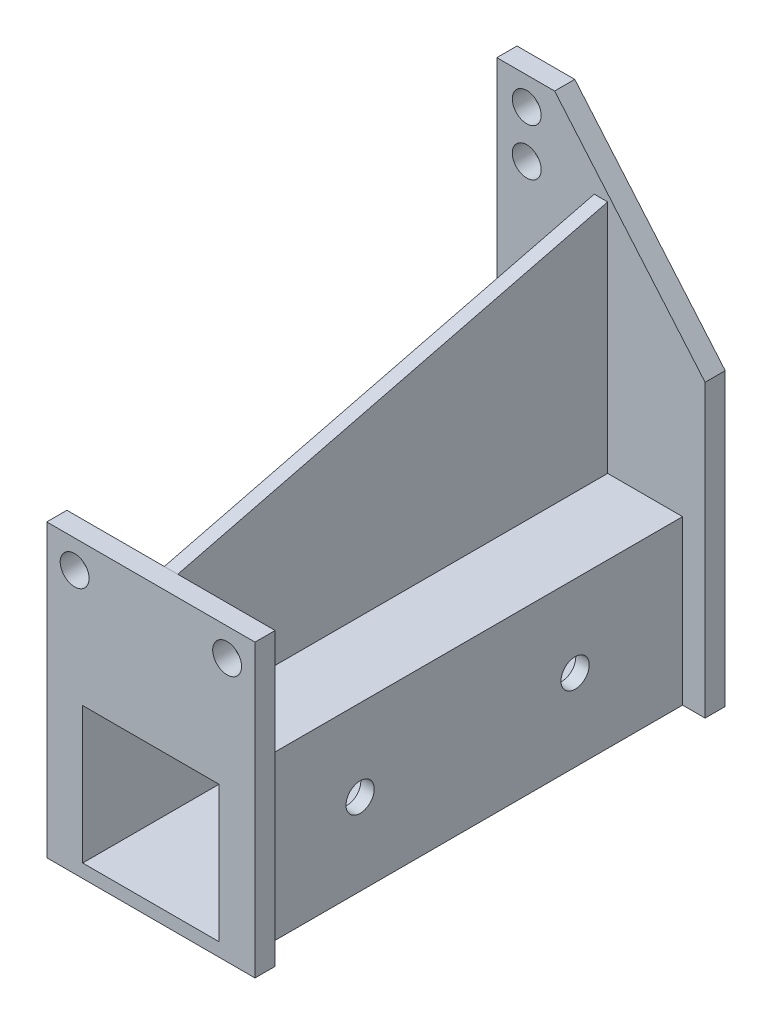
ISO-10303-21;
HEADER;
FILE_DESCRIPTION(('STEP AP214'),'2;1');
FILE_NAME('part.step','',(''),(''),'','','');
FILE_SCHEMA(('AUTOMOTIVE_DESIGN { 1 0 10303 214 1 1 1 1 }'));
ENDSEC;
DATA;
#1=APPLICATION_CONTEXT('core data for automotive mechanical design processes');
#2=APPLICATION_PROTOCOL_DEFINITION('international standard','automotive_design',2000,#1);
#3=PRODUCT_CONTEXT('',#1,'mechanical');
#4=PRODUCT('Part','Part','',(#3));
#5=PRODUCT_RELATED_PRODUCT_CATEGORY('part','',(#4));
#6=PRODUCT_DEFINITION_FORMATION('','',#4);
#7=PRODUCT_DEFINITION_CONTEXT('part definition',#1,'design');
#8=PRODUCT_DEFINITION('design','',#6,#7);
#9=PRODUCT_DEFINITION_SHAPE('','',#8);
#10=(LENGTH_UNIT() NAMED_UNIT(*) SI_UNIT(.MILLI.,.METRE.));
#11=(NAMED_UNIT(*) PLANE_ANGLE_UNIT() SI_UNIT($,.RADIAN.));
#12=(NAMED_UNIT(*) SI_UNIT($,.STERADIAN.) SOLID_ANGLE_UNIT());
#13=UNCERTAINTY_MEASURE_WITH_UNIT(LENGTH_MEASURE(1.E-05),#10,'distance_accuracy_value','');
#14=(GEOMETRIC_REPRESENTATION_CONTEXT(3) GLOBAL_UNCERTAINTY_ASSIGNED_CONTEXT((#13)) GLOBAL_UNIT_ASSIGNED_CONTEXT((#10,
#11,#12)) REPRESENTATION_CONTEXT('',''));
#15=CARTESIAN_POINT('',(0.,0.,0.));
#16=DIRECTION('',(0.,0.,1.));
#17=DIRECTION('',(1.,0.,0.));
#18=AXIS2_PLACEMENT_3D('',#15,#16,#17);
#19=CARTESIAN_POINT('',(-12.15,12.15,35.));
#20=DIRECTION('',(0.,-1.,0.));
#21=DIRECTION('',(0.,0.,-1.));
#22=AXIS2_PLACEMENT_3D('',#19,#20,#21);
#23=PLANE('',#22);
#24=DIRECTION('',(0.,0.,-1.));
#25=VECTOR('',#24,1.);
#26=CARTESIAN_POINT('',(1.,12.15,32.));
#27=LINE('',#26,#25);
#28=CARTESIAN_POINT('',(1.,12.15,32.));
#29=VERTEX_POINT('',#28);
#30=CARTESIAN_POINT('',(1.,12.15,-32.));
#31=VERTEX_POINT('',#30);
#32=EDGE_CURVE('E189',#29,#31,#27,.T.);
#33=ORIENTED_EDGE('',*,*,#32,.F.);
#34=DIRECTION('',(-1.,0.,0.));
#35=VECTOR('',#34,1.);
#36=CARTESIAN_POINT('',(0.,12.15,32.));
#37=LINE('',#36,#35);
#38=CARTESIAN_POINT('',(12.15,12.15,32.));
#39=VERTEX_POINT('',#38);
#40=EDGE_CURVE('E199',#39,#29,#37,.T.);
#41=ORIENTED_EDGE('',*,*,#40,.F.);
#42=DIRECTION('',(0.,0.,-1.));
#43=VECTOR('',#42,1.);
#44=CARTESIAN_POINT('',(12.15,12.15,35.));
#45=LINE('',#44,#43);
#46=CARTESIAN_POINT('',(12.15,12.15,-32.));
#47=VERTEX_POINT('',#46);
#48=EDGE_CURVE('E11',#39,#47,#45,.T.);
#49=ORIENTED_EDGE('',*,*,#48,.T.);
#50=DIRECTION('',(1.,0.,0.));
#51=VECTOR('',#50,1.);
#52=CARTESIAN_POINT('',(0.,12.15,-32.));
#53=LINE('',#52,#51);
#54=EDGE_CURVE('E65',#31,#47,#53,.T.);
#55=ORIENTED_EDGE('',*,*,#54,.F.);
#56=EDGE_LOOP('',(#33,#41,#49,#55));
#57=FACE_BOUND('',#56,.T.);
#58=ADVANCED_FACE('F40',(#57),#23,.F.);
#59=CARTESIAN_POINT('',(0.,0.,32.));
#60=DIRECTION('',(0.,0.,1.));
#61=DIRECTION('',(1.,0.,0.));
#62=AXIS2_PLACEMENT_3D('',#59,#60,#61);
#63=PLANE('',#62);
#64=CARTESIAN_POINT('',(11.35,27.,32.));
#65=DIRECTION('',(0.,0.,1.));
#66=DIRECTION('',(1.,0.,0.));
#67=AXIS2_PLACEMENT_3D('',#64,#65,#66);
#68=CIRCLE('',#67,2.15);
#69=CARTESIAN_POINT('',(13.5,27.,32.));
#70=VERTEX_POINT('',#69);
#71=EDGE_CURVE('E208',#70,#70,#68,.T.);
#72=ORIENTED_EDGE('',*,*,#71,.T.);
#73=EDGE_LOOP('',(#72));
#74=FACE_BOUND('',#73,.T.);
#75=DIRECTION('',(0.,-1.,0.));
#76=VECTOR('',#75,1.);
#77=CARTESIAN_POINT('',(1.,12.15,32.));
#78=LINE('',#77,#76);
#79=CARTESIAN_POINT('',(1.,31.15,32.));
#80=VERTEX_POINT('',#79);
#81=EDGE_CURVE('E186',#80,#29,#78,.T.);
#82=ORIENTED_EDGE('',*,*,#81,.F.);
#83=DIRECTION('',(1.,0.,0.));
#84=VECTOR('',#83,1.);
#85=CARTESIAN_POINT('',(0.,31.15,32.));
#86=LINE('',#85,#84);
#87=CARTESIAN_POINT('',(15.5,31.15,32.));
#88=VERTEX_POINT('',#87);
#89=EDGE_CURVE('E394',#80,#88,#86,.T.);
#90=ORIENTED_EDGE('',*,*,#89,.T.);
#91=DIRECTION('',(0.,-1.,0.));
#92=VECTOR('',#91,1.);
#93=CARTESIAN_POINT('',(15.5,0.,32.));
#94=LINE('',#93,#92);
#95=CARTESIAN_POINT('',(15.5,-12.15,32.));
#96=VERTEX_POINT('',#95);
#97=EDGE_CURVE('E392',#88,#96,#94,.T.);
#98=ORIENTED_EDGE('',*,*,#97,.T.);
#99=DIRECTION('',(1.,0.,0.));
#100=VECTOR('',#99,1.);
#101=CARTESIAN_POINT('',(0.,-12.15,32.));
#102=LINE('',#101,#100);
#103=CARTESIAN_POINT('',(12.15,-12.15,32.));
#104=VERTEX_POINT('',#103);
#105=EDGE_CURVE('E234',#104,#96,#102,.T.);
#106=ORIENTED_EDGE('',*,*,#105,.F.);
#107=DIRECTION('',(0.,1.,0.));
#108=VECTOR('',#107,1.);
#109=CARTESIAN_POINT('',(12.15,0.,32.));
#110=LINE('',#109,#108);
#111=EDGE_CURVE('E205',#104,#39,#110,.T.);
#112=ORIENTED_EDGE('',*,*,#111,.T.);
#113=ORIENTED_EDGE('',*,*,#40,.T.);
#114=EDGE_LOOP('',(#82,#90,#98,#106,#112,#113));
#115=FACE_BOUND('',#114,.T.);
#116=ADVANCED_FACE('F203',(#74,#115),#63,.F.);
#117=CARTESIAN_POINT('',(0.,0.,-32.));
#118=DIRECTION('',(0.,0.,-1.));
#119=DIRECTION('',(-1.,0.,0.));
#120=AXIS2_PLACEMENT_3D('',#117,#118,#119);
#121=PLANE('',#120);
#122=CARTESIAN_POINT('',(-11.05,46.35,-32.));
#123=DIRECTION('',(0.,0.,-1.));
#124=DIRECTION('',(-1.,0.,0.));
#125=AXIS2_PLACEMENT_3D('',#122,#123,#124);
#126=CIRCLE('',#125,2.15);
#127=CARTESIAN_POINT('',(-13.2,46.35,-32.));
#128=VERTEX_POINT('',#127);
#129=EDGE_CURVE('E333',#128,#128,#126,.T.);
#130=ORIENTED_EDGE('',*,*,#129,.T.);
#131=EDGE_LOOP('',(#130));
#132=FACE_BOUND('',#131,.T.);
#133=CARTESIAN_POINT('',(-11.05,53.35,-32.));
#134=DIRECTION('',(0.,0.,-1.));
#135=DIRECTION('',(-1.,0.,0.));
#136=AXIS2_PLACEMENT_3D('',#133,#134,#135);
#137=CIRCLE('',#136,2.15);
#138=CARTESIAN_POINT('',(-13.2,53.35,-32.));
#139=VERTEX_POINT('',#138);
#140=EDGE_CURVE('E330',#139,#139,#137,.T.);
#141=ORIENTED_EDGE('',*,*,#140,.T.);
#142=EDGE_LOOP('',(#141));
#143=FACE_BOUND('',#142,.T.);
#144=DIRECTION('',(0.,1.,0.));
#145=VECTOR('',#144,1.);
#146=CARTESIAN_POINT('',(1.,47.15,-32.));
#147=LINE('',#146,#145);
#148=CARTESIAN_POINT('',(1.,47.15,-32.));
#149=VERTEX_POINT('',#148);
#150=EDGE_CURVE('E201',#31,#149,#147,.T.);
#151=ORIENTED_EDGE('',*,*,#150,.F.);
#152=ORIENTED_EDGE('',*,*,#54,.T.);
#153=DIRECTION('',(0.,-1.,0.));
#154=VECTOR('',#153,1.);
#155=CARTESIAN_POINT('',(12.15,0.,-32.));
#156=LINE('',#155,#154);
#157=CARTESIAN_POINT('',(12.15,-12.15,-32.));
#158=VERTEX_POINT('',#157);
#159=EDGE_CURVE('E358',#47,#158,#156,.T.);
#160=ORIENTED_EDGE('',*,*,#159,.T.);
#161=DIRECTION('',(-1.,0.,0.));
#162=VECTOR('',#161,1.);
#163=CARTESIAN_POINT('',(0.,-12.15,-32.));
#164=LINE('',#163,#162);
#165=CARTESIAN_POINT('',(15.5,-12.15,-32.));
#166=VERTEX_POINT('',#165);
#167=EDGE_CURVE('E355',#166,#158,#164,.T.);
#168=ORIENTED_EDGE('',*,*,#167,.F.);
#169=DIRECTION('',(0.,-1.,0.));
#170=VECTOR('',#169,1.);
#171=CARTESIAN_POINT('',(15.5,0.,-32.));
#172=LINE('',#171,#170);
#173=CARTESIAN_POINT('',(15.5,31.15,-32.));
#174=VERTEX_POINT('',#173);
#175=EDGE_CURVE('E352',#174,#166,#172,.T.);
#176=ORIENTED_EDGE('',*,*,#175,.F.);
#177=DIRECTION('',(0.647690385367679,-0.761903645287426,0.));
#178=VECTOR('',#177,1.);
#179=CARTESIAN_POINT('',(24.3695353372363,20.7164171367778,-32.));
#180=LINE('',#179,#178);
#181=CARTESIAN_POINT('',(-6.9,57.5,-32.));
#182=VERTEX_POINT('',#181);
#183=EDGE_CURVE('E349',#182,#174,#180,.T.);
#184=ORIENTED_EDGE('',*,*,#183,.F.);
#185=DIRECTION('',(1.,0.,0.));
#186=VECTOR('',#185,1.);
#187=CARTESIAN_POINT('',(0.,57.5,-32.));
#188=LINE('',#187,#186);
#189=CARTESIAN_POINT('',(-15.5,57.5,-32.));
#190=VERTEX_POINT('',#189);
#191=EDGE_CURVE('E346',#190,#182,#188,.T.);
#192=ORIENTED_EDGE('',*,*,#191,.F.);
#193=DIRECTION('',(0.,1.,0.));
#194=VECTOR('',#193,1.);
#195=CARTESIAN_POINT('',(-15.5,0.,-32.));
#196=LINE('',#195,#194);
#197=CARTESIAN_POINT('',(-15.5,-12.15,-32.));
#198=VERTEX_POINT('',#197);
#199=EDGE_CURVE('E343',#198,#190,#196,.T.);
#200=ORIENTED_EDGE('',*,*,#199,.F.);
#201=DIRECTION('',(-1.,0.,0.));
#202=VECTOR('',#201,1.);
#203=CARTESIAN_POINT('',(0.,-12.15,-32.));
#204=LINE('',#203,#202);
#205=CARTESIAN_POINT('',(-12.15,-12.15,-32.));
#206=VERTEX_POINT('',#205);
#207=EDGE_CURVE('E340',#206,#198,#204,.T.);
#208=ORIENTED_EDGE('',*,*,#207,.F.);
#209=DIRECTION('',(0.,1.,0.));
#210=VECTOR('',#209,1.);
#211=CARTESIAN_POINT('',(-12.15,0.,-32.));
#212=LINE('',#211,#210);
#213=CARTESIAN_POINT('',(-12.15,12.15,-32.));
#214=VERTEX_POINT('',#213);
#215=EDGE_CURVE('E337',#206,#214,#212,.T.);
#216=ORIENTED_EDGE('',*,*,#215,.T.);
#217=CARTESIAN_POINT('',(-1.,12.15,-32.));
#218=VERTEX_POINT('',#217);
#219=EDGE_CURVE('E360',#214,#218,#53,.T.);
#220=ORIENTED_EDGE('',*,*,#219,.T.);
#221=DIRECTION('',(0.,1.,0.));
#222=VECTOR('',#221,1.);
#223=CARTESIAN_POINT('',(-1.,47.15,-32.));
#224=LINE('',#223,#222);
#225=CARTESIAN_POINT('',(-1.,47.15,-32.));
#226=VERTEX_POINT('',#225);
#227=EDGE_CURVE('E321',#218,#226,#224,.T.);
#228=ORIENTED_EDGE('',*,*,#227,.T.);
#229=DIRECTION('',(-1.,0.,0.));
#230=VECTOR('',#229,1.);
#231=CARTESIAN_POINT('',(1.,47.15,-32.));
#232=LINE('',#231,#230);
#233=EDGE_CURVE('E327',#149,#226,#232,.T.);
#234=ORIENTED_EDGE('',*,*,#233,.F.);
#235=EDGE_LOOP('',(#151,#152,#160,#168,#176,#184,#192,#200,#208,#216,#220,#228,#234));
#236=FACE_BOUND('',#235,.T.);
#237=ADVANCED_FACE('F415',(#132,#143,#236),#121,.F.);
#238=CARTESIAN_POINT('',(12.15,-12.15,35.));
#239=DIRECTION('',(-1.,0.,0.));
#240=DIRECTION('',(0.,0.,1.));
#241=AXIS2_PLACEMENT_3D('',#238,#239,#240);
#242=PLANE('',#241);
#243=CARTESIAN_POINT('',(12.15,0.,16.));
#244=DIRECTION('',(1.,0.,0.));
#245=DIRECTION('',(0.,0.,-1.));
#246=AXIS2_PLACEMENT_3D('',#243,#244,#245);
#247=CIRCLE('',#246,2.1);
#248=CARTESIAN_POINT('',(12.15,0.,13.9));
#249=VERTEX_POINT('',#248);
#250=EDGE_CURVE('E290',#249,#249,#247,.T.);
#251=ORIENTED_EDGE('',*,*,#250,.F.);
#252=EDGE_LOOP('',(#251));
#253=FACE_BOUND('',#252,.T.);
#254=CARTESIAN_POINT('',(12.15,0.,-16.));
#255=DIRECTION('',(1.,0.,0.));
#256=DIRECTION('',(0.,0.,-1.));
#257=AXIS2_PLACEMENT_3D('',#254,#255,#256);
#258=CIRCLE('',#257,2.1);
#259=CARTESIAN_POINT('',(12.15,0.,-18.1));
#260=VERTEX_POINT('',#259);
#261=EDGE_CURVE('E297',#260,#260,#258,.T.);
#262=ORIENTED_EDGE('',*,*,#261,.F.);
#263=EDGE_LOOP('',(#262));
#264=FACE_BOUND('',#263,.T.);
#265=ORIENTED_EDGE('',*,*,#159,.F.);
#266=ORIENTED_EDGE('',*,*,#48,.F.);
#267=ORIENTED_EDGE('',*,*,#111,.F.);
#268=DIRECTION('',(0.,0.,-1.));
#269=VECTOR('',#268,1.);
#270=CARTESIAN_POINT('',(12.15,-12.15,35.));
#271=LINE('',#270,#269);
#272=EDGE_CURVE('E280',#104,#158,#271,.T.);
#273=ORIENTED_EDGE('',*,*,#272,.T.);
#274=EDGE_LOOP('',(#265,#266,#267,#273));
#275=FACE_BOUND('',#274,.T.);
#276=ADVANCED_FACE('F42',(#253,#264,#275),#242,.F.);
#277=CARTESIAN_POINT('',(-1.,12.15,32.));
#278=VERTEX_POINT('',#277);
#279=CARTESIAN_POINT('',(-12.15,12.15,32.));
#280=VERTEX_POINT('',#279);
#281=EDGE_CURVE('E206',#278,#280,#37,.T.);
#282=ORIENTED_EDGE('',*,*,#281,.F.);
#283=DIRECTION('',(0.,0.,-1.));
#284=VECTOR('',#283,1.);
#285=CARTESIAN_POINT('',(-1.,12.15,32.));
#286=LINE('',#285,#284);
#287=EDGE_CURVE('E318',#278,#218,#286,.T.);
#288=ORIENTED_EDGE('',*,*,#287,.T.);
#289=ORIENTED_EDGE('',*,*,#219,.F.);
#290=DIRECTION('',(0.,0.,-1.));
#291=VECTOR('',#290,1.);
#292=CARTESIAN_POINT('',(-12.15,12.15,35.));
#293=LINE('',#292,#291);
#294=EDGE_CURVE('E49',#280,#214,#293,.T.);
#295=ORIENTED_EDGE('',*,*,#294,.F.);
#296=EDGE_LOOP('',(#282,#288,#289,#295));
#297=FACE_BOUND('',#296,.T.);
#298=ADVANCED_FACE('F436',(#297),#23,.F.);
#299=CARTESIAN_POINT('',(-12.15,-12.15,35.));
#300=DIRECTION('',(1.,0.,0.));
#301=DIRECTION('',(0.,0.,-1.));
#302=AXIS2_PLACEMENT_3D('',#299,#300,#301);
#303=PLANE('',#302);
#304=CARTESIAN_POINT('',(-12.15,0.,16.));
#305=DIRECTION('',(1.,0.,0.));
#306=DIRECTION('',(0.,0.,-1.));
#307=AXIS2_PLACEMENT_3D('',#304,#305,#306);
#308=CIRCLE('',#307,2.1);
#309=CARTESIAN_POINT('',(-12.15,0.,13.9));
#310=VERTEX_POINT('',#309);
#311=EDGE_CURVE('E309',#310,#310,#308,.T.);
#312=ORIENTED_EDGE('',*,*,#311,.T.);
#313=EDGE_LOOP('',(#312));
#314=FACE_BOUND('',#313,.T.);
#315=CARTESIAN_POINT('',(-12.15,0.,-16.));
#316=DIRECTION('',(1.,0.,0.));
#317=DIRECTION('',(0.,0.,-1.));
#318=AXIS2_PLACEMENT_3D('',#315,#316,#317);
#319=CIRCLE('',#318,2.1);
#320=CARTESIAN_POINT('',(-12.15,0.,-18.1));
#321=VERTEX_POINT('',#320);
#322=EDGE_CURVE('E294',#321,#321,#319,.T.);
#323=ORIENTED_EDGE('',*,*,#322,.T.);
#324=EDGE_LOOP('',(#323));
#325=FACE_BOUND('',#324,.T.);
#326=ORIENTED_EDGE('',*,*,#215,.F.);
#327=DIRECTION('',(0.,0.,-1.));
#328=VECTOR('',#327,1.);
#329=CARTESIAN_POINT('',(-12.15,-12.15,35.));
#330=LINE('',#329,#328);
#331=CARTESIAN_POINT('',(-12.15,-12.15,32.));
#332=VERTEX_POINT('',#331);
#333=EDGE_CURVE('E283',#332,#206,#330,.T.);
#334=ORIENTED_EDGE('',*,*,#333,.F.);
#335=DIRECTION('',(0.,-1.,0.));
#336=VECTOR('',#335,1.);
#337=CARTESIAN_POINT('',(-12.15,0.,32.));
#338=LINE('',#337,#336);
#339=EDGE_CURVE('E210',#280,#332,#338,.T.);
#340=ORIENTED_EDGE('',*,*,#339,.F.);
#341=ORIENTED_EDGE('',*,*,#294,.T.);
#342=EDGE_LOOP('',(#326,#334,#340,#341));
#343=FACE_BOUND('',#342,.T.);
#344=ADVANCED_FACE('F410',(#314,#325,#343),#303,.F.);
#345=CARTESIAN_POINT('',(0.,0.,35.));
#346=DIRECTION('',(0.,0.,-1.));
#347=DIRECTION('',(-1.,0.,0.));
#348=AXIS2_PLACEMENT_3D('',#345,#346,#347);
#349=PLANE('',#348);
#350=DIRECTION('',(1.,0.,0.));
#351=VECTOR('',#350,1.);
#352=CARTESIAN_POINT('',(-12.15,-12.15,35.));
#353=LINE('',#352,#351);
#354=CARTESIAN_POINT('',(-15.5,-12.15,35.));
#355=VERTEX_POINT('',#354);
#356=CARTESIAN_POINT('',(15.5,-12.15,35.));
#357=VERTEX_POINT('',#356);
#358=EDGE_CURVE('E278',#355,#357,#353,.T.);
#359=ORIENTED_EDGE('',*,*,#358,.T.);
#360=DIRECTION('',(0.,-1.,0.));
#361=VECTOR('',#360,1.);
#362=CARTESIAN_POINT('',(15.5,0.,35.));
#363=LINE('',#362,#361);
#364=CARTESIAN_POINT('',(15.5,31.15,35.));
#365=VERTEX_POINT('',#364);
#366=EDGE_CURVE('E220',#365,#357,#363,.T.);
#367=ORIENTED_EDGE('',*,*,#366,.F.);
#368=DIRECTION('',(1.,0.,0.));
#369=VECTOR('',#368,1.);
#370=CARTESIAN_POINT('',(0.,31.15,35.));
#371=LINE('',#370,#369);
#372=CARTESIAN_POINT('',(-15.5,31.15,35.));
#373=VERTEX_POINT('',#372);
#374=EDGE_CURVE('E223',#373,#365,#371,.T.);
#375=ORIENTED_EDGE('',*,*,#374,.F.);
#376=DIRECTION('',(0.,1.,0.));
#377=VECTOR('',#376,1.);
#378=CARTESIAN_POINT('',(-15.5,0.,35.));
#379=LINE('',#378,#377);
#380=EDGE_CURVE('E226',#355,#373,#379,.T.);
#381=ORIENTED_EDGE('',*,*,#380,.F.);
#382=EDGE_LOOP('',(#359,#367,#375,#381));
#383=FACE_BOUND('',#382,.T.);
#384=DIRECTION('',(0.,1.,0.));
#385=VECTOR('',#384,1.);
#386=CARTESIAN_POINT('',(10.15,-10.15,35.));
#387=LINE('',#386,#385);
#388=CARTESIAN_POINT('',(10.15,-10.15,35.));
#389=VERTEX_POINT('',#388);
#390=CARTESIAN_POINT('',(10.15,10.15,35.));
#391=VERTEX_POINT('',#390);
#392=EDGE_CURVE('E247',#389,#391,#387,.T.);
#393=ORIENTED_EDGE('',*,*,#392,.F.);
#394=DIRECTION('',(1.,0.,0.));
#395=VECTOR('',#394,1.);
#396=CARTESIAN_POINT('',(-10.15,-10.15,35.));
#397=LINE('',#396,#395);
#398=CARTESIAN_POINT('',(-10.15,-10.15,35.));
#399=VERTEX_POINT('',#398);
#400=EDGE_CURVE('E255',#399,#389,#397,.T.);
#401=ORIENTED_EDGE('',*,*,#400,.F.);
#402=DIRECTION('',(0.,-1.,0.));
#403=VECTOR('',#402,1.);
#404=CARTESIAN_POINT('',(-10.15,-10.15,35.));
#405=LINE('',#404,#403);
#406=CARTESIAN_POINT('',(-10.15,10.15,35.));
#407=VERTEX_POINT('',#406);
#408=EDGE_CURVE('E252',#407,#399,#405,.T.);
#409=ORIENTED_EDGE('',*,*,#408,.F.);
#410=DIRECTION('',(-1.,0.,0.));
#411=VECTOR('',#410,1.);
#412=CARTESIAN_POINT('',(-10.15,10.15,35.));
#413=LINE('',#412,#411);
#414=EDGE_CURVE('E249',#391,#407,#413,.T.);
#415=ORIENTED_EDGE('',*,*,#414,.F.);
#416=EDGE_LOOP('',(#393,#401,#409,#415));
#417=FACE_BOUND('',#416,.T.);
#418=CARTESIAN_POINT('',(11.35,27.,35.));
#419=DIRECTION('',(0.,0.,1.));
#420=DIRECTION('',(1.,0.,0.));
#421=AXIS2_PLACEMENT_3D('',#418,#419,#420);
#422=CIRCLE('',#421,2.15);
#423=CARTESIAN_POINT('',(13.5,27.,35.));
#424=VERTEX_POINT('',#423);
#425=EDGE_CURVE('E228',#424,#424,#422,.T.);
#426=ORIENTED_EDGE('',*,*,#425,.F.);
#427=EDGE_LOOP('',(#426));
#428=FACE_BOUND('',#427,.T.);
#429=CARTESIAN_POINT('',(-11.35,27.,35.));
#430=DIRECTION('',(0.,0.,1.));
#431=DIRECTION('',(1.,0.,0.));
#432=AXIS2_PLACEMENT_3D('',#429,#430,#431);
#433=CIRCLE('',#432,2.15);
#434=CARTESIAN_POINT('',(-9.2,27.,35.));
#435=VERTEX_POINT('',#434);
#436=EDGE_CURVE('E231',#435,#435,#433,.F.);
#437=ORIENTED_EDGE('',*,*,#436,.T.);
#438=EDGE_LOOP('',(#437));
#439=FACE_BOUND('',#438,.T.);
#440=ADVANCED_FACE('F455',(#383,#417,#428,#439),#349,.F.);
#441=CARTESIAN_POINT('',(0.,0.,-35.));
#442=DIRECTION('',(0.,0.,-1.));
#443=DIRECTION('',(-1.,0.,0.));
#444=AXIS2_PLACEMENT_3D('',#441,#442,#443);
#445=PLANE('',#444);
#446=DIRECTION('',(1.,0.,0.));
#447=VECTOR('',#446,1.);
#448=CARTESIAN_POINT('',(-12.15,-12.15,-35.));
#449=LINE('',#448,#447);
#450=CARTESIAN_POINT('',(-15.5,-12.15,-35.));
#451=VERTEX_POINT('',#450);
#452=CARTESIAN_POINT('',(15.5,-12.15,-35.));
#453=VERTEX_POINT('',#452);
#454=EDGE_CURVE('E277',#451,#453,#449,.T.);
#455=ORIENTED_EDGE('',*,*,#454,.F.);
#456=DIRECTION('',(0.,1.,0.));
#457=VECTOR('',#456,1.);
#458=CARTESIAN_POINT('',(-15.5,0.,-35.));
#459=LINE('',#458,#457);
#460=CARTESIAN_POINT('',(-15.5,57.5,-35.));
#461=VERTEX_POINT('',#460);
#462=EDGE_CURVE('E369',#451,#461,#459,.T.);
#463=ORIENTED_EDGE('',*,*,#462,.T.);
#464=DIRECTION('',(1.,0.,0.));
#465=VECTOR('',#464,1.);
#466=CARTESIAN_POINT('',(0.,57.5,-35.));
#467=LINE('',#466,#465);
#468=CARTESIAN_POINT('',(-6.9,57.5,-35.));
#469=VERTEX_POINT('',#468);
#470=EDGE_CURVE('E372',#461,#469,#467,.T.);
#471=ORIENTED_EDGE('',*,*,#470,.T.);
#472=DIRECTION('',(0.647690385367679,-0.761903645287426,0.));
#473=VECTOR('',#472,1.);
#474=CARTESIAN_POINT('',(24.3695353372363,20.7164171367778,-35.));
#475=LINE('',#474,#473);
#476=CARTESIAN_POINT('',(15.5,31.15,-35.));
#477=VERTEX_POINT('',#476);
#478=EDGE_CURVE('E375',#469,#477,#475,.T.);
#479=ORIENTED_EDGE('',*,*,#478,.T.);
#480=DIRECTION('',(0.,-1.,0.));
#481=VECTOR('',#480,1.);
#482=CARTESIAN_POINT('',(15.5,0.,-35.));
#483=LINE('',#482,#481);
#484=EDGE_CURVE('E334',#477,#453,#483,.T.);
#485=ORIENTED_EDGE('',*,*,#484,.T.);
#486=EDGE_LOOP('',(#455,#463,#471,#479,#485));
#487=FACE_BOUND('',#486,.T.);
#488=DIRECTION('',(1.,0.,0.));
#489=VECTOR('',#488,1.);
#490=CARTESIAN_POINT('',(-10.15,-10.15,-35.));
#491=LINE('',#490,#489);
#492=CARTESIAN_POINT('',(-10.15,-10.15,-35.));
#493=VERTEX_POINT('',#492);
#494=CARTESIAN_POINT('',(10.15,-10.15,-35.));
#495=VERTEX_POINT('',#494);
#496=EDGE_CURVE('E250',#493,#495,#491,.T.);
#497=ORIENTED_EDGE('',*,*,#496,.T.);
#498=DIRECTION('',(0.,1.,0.));
#499=VECTOR('',#498,1.);
#500=CARTESIAN_POINT('',(10.15,-10.15,-35.));
#501=LINE('',#500,#499);
#502=CARTESIAN_POINT('',(10.15,10.15,-35.));
#503=VERTEX_POINT('',#502);
#504=EDGE_CURVE('E238',#495,#503,#501,.T.);
#505=ORIENTED_EDGE('',*,*,#504,.T.);
#506=DIRECTION('',(-1.,0.,0.));
#507=VECTOR('',#506,1.);
#508=CARTESIAN_POINT('',(-10.15,10.15,-35.));
#509=LINE('',#508,#507);
#510=CARTESIAN_POINT('',(-10.15,10.15,-35.));
#511=VERTEX_POINT('',#510);
#512=EDGE_CURVE('E260',#503,#511,#509,.T.);
#513=ORIENTED_EDGE('',*,*,#512,.T.);
#514=DIRECTION('',(0.,-1.,0.));
#515=VECTOR('',#514,1.);
#516=CARTESIAN_POINT('',(-10.15,-10.15,-35.));
#517=LINE('',#516,#515);
#518=EDGE_CURVE('E263',#511,#493,#517,.T.);
#519=ORIENTED_EDGE('',*,*,#518,.T.);
#520=EDGE_LOOP('',(#497,#505,#513,#519));
#521=FACE_BOUND('',#520,.T.);
#522=CARTESIAN_POINT('',(-11.05,53.35,-35.));
#523=DIRECTION('',(0.,0.,-1.));
#524=DIRECTION('',(-1.,0.,0.));
#525=AXIS2_PLACEMENT_3D('',#522,#523,#524);
#526=CIRCLE('',#525,2.15);
#527=CARTESIAN_POINT('',(-13.2,53.35,-35.));
#528=VERTEX_POINT('',#527);
#529=EDGE_CURVE('E329',#528,#528,#526,.T.);
#530=ORIENTED_EDGE('',*,*,#529,.F.);
#531=EDGE_LOOP('',(#530));
#532=FACE_BOUND('',#531,.T.);
#533=CARTESIAN_POINT('',(-11.05,46.35,-35.));
#534=DIRECTION('',(0.,0.,-1.));
#535=DIRECTION('',(-1.,0.,0.));
#536=AXIS2_PLACEMENT_3D('',#533,#534,#535);
#537=CIRCLE('',#536,2.15);
#538=CARTESIAN_POINT('',(-13.2,46.35,-35.));
#539=VERTEX_POINT('',#538);
#540=EDGE_CURVE('E366',#539,#539,#537,.T.);
#541=ORIENTED_EDGE('',*,*,#540,.F.);
#542=EDGE_LOOP('',(#541));
#543=FACE_BOUND('',#542,.T.);
#544=ADVANCED_FACE('F428',(#487,#521,#532,#543),#445,.T.);
#545=CARTESIAN_POINT('',(-12.15,-12.15,35.));
#546=DIRECTION('',(0.,1.,0.));
#547=DIRECTION('',(0.,0.,1.));
#548=AXIS2_PLACEMENT_3D('',#545,#546,#547);
#549=PLANE('',#548);
#550=ORIENTED_EDGE('',*,*,#454,.T.);
#551=DIRECTION('',(0.,0.,-1.));
#552=VECTOR('',#551,1.);
#553=CARTESIAN_POINT('',(15.5,-12.15,-32.));
#554=LINE('',#553,#552);
#555=EDGE_CURVE('E224',#166,#453,#554,.T.);
#556=ORIENTED_EDGE('',*,*,#555,.F.);
#557=ORIENTED_EDGE('',*,*,#167,.T.);
#558=ORIENTED_EDGE('',*,*,#272,.F.);
#559=ORIENTED_EDGE('',*,*,#105,.T.);
#560=DIRECTION('',(0.,0.,1.));
#561=VECTOR('',#560,1.);
#562=CARTESIAN_POINT('',(15.5,-12.15,32.));
#563=LINE('',#562,#561);
#564=EDGE_CURVE('E219',#96,#357,#563,.T.);
#565=ORIENTED_EDGE('',*,*,#564,.T.);
#566=ORIENTED_EDGE('',*,*,#358,.F.);
#567=DIRECTION('',(0.,0.,1.));
#568=VECTOR('',#567,1.);
#569=CARTESIAN_POINT('',(-15.5,-12.15,32.));
#570=LINE('',#569,#568);
#571=CARTESIAN_POINT('',(-15.5,-12.15,32.));
#572=VERTEX_POINT('',#571);
#573=EDGE_CURVE('E235',#572,#355,#570,.T.);
#574=ORIENTED_EDGE('',*,*,#573,.F.);
#575=DIRECTION('',(-1.,0.,0.));
#576=VECTOR('',#575,1.);
#577=CARTESIAN_POINT('',(0.,-12.15,32.));
#578=LINE('',#577,#576);
#579=EDGE_CURVE('E399',#332,#572,#578,.T.);
#580=ORIENTED_EDGE('',*,*,#579,.F.);
#581=ORIENTED_EDGE('',*,*,#333,.T.);
#582=ORIENTED_EDGE('',*,*,#207,.T.);
#583=DIRECTION('',(0.,0.,-1.));
#584=VECTOR('',#583,1.);
#585=CARTESIAN_POINT('',(-15.5,-12.15,-32.));
#586=LINE('',#585,#584);
#587=EDGE_CURVE('E363',#198,#451,#586,.T.);
#588=ORIENTED_EDGE('',*,*,#587,.T.);
#589=EDGE_LOOP('',(#550,#556,#557,#558,#559,#565,#566,#574,#580,#581,#582,#588));
#590=FACE_BOUND('',#589,.T.);
#591=ADVANCED_FACE('F413',(#590),#549,.F.);
#592=CARTESIAN_POINT('',(10.15,-10.15,35.));
#593=DIRECTION('',(-1.,0.,0.));
#594=DIRECTION('',(0.,0.,1.));
#595=AXIS2_PLACEMENT_3D('',#592,#593,#594);
#596=PLANE('',#595);
#597=CARTESIAN_POINT('',(10.15,0.,16.));
#598=DIRECTION('',(-1.,0.,0.));
#599=DIRECTION('',(0.,0.,1.));
#600=AXIS2_PLACEMENT_3D('',#597,#598,#599);
#601=CIRCLE('',#600,2.1);
#602=CARTESIAN_POINT('',(10.15,0.,18.1));
#603=VERTEX_POINT('',#602);
#604=EDGE_CURVE('E306',#603,#603,#601,.T.);
#605=ORIENTED_EDGE('',*,*,#604,.F.);
#606=EDGE_LOOP('',(#605));
#607=FACE_BOUND('',#606,.T.);
#608=CARTESIAN_POINT('',(10.15,0.,-16.));
#609=DIRECTION('',(-1.,0.,0.));
#610=DIRECTION('',(0.,0.,1.));
#611=AXIS2_PLACEMENT_3D('',#608,#609,#610);
#612=CIRCLE('',#611,2.1);
#613=CARTESIAN_POINT('',(10.15,0.,-13.9));
#614=VERTEX_POINT('',#613);
#615=EDGE_CURVE('E289',#614,#614,#612,.T.);
#616=ORIENTED_EDGE('',*,*,#615,.F.);
#617=EDGE_LOOP('',(#616));
#618=FACE_BOUND('',#617,.T.);
#619=ORIENTED_EDGE('',*,*,#504,.F.);
#620=DIRECTION('',(0.,0.,-1.));
#621=VECTOR('',#620,1.);
#622=CARTESIAN_POINT('',(10.15,-10.15,35.));
#623=LINE('',#622,#621);
#624=EDGE_CURVE('E257',#389,#495,#623,.T.);
#625=ORIENTED_EDGE('',*,*,#624,.F.);
#626=ORIENTED_EDGE('',*,*,#392,.T.);
#627=DIRECTION('',(0.,0.,-1.));
#628=VECTOR('',#627,1.);
#629=CARTESIAN_POINT('',(10.15,10.15,35.));
#630=LINE('',#629,#628);
#631=EDGE_CURVE('E274',#391,#503,#630,.T.);
#632=ORIENTED_EDGE('',*,*,#631,.T.);
#633=EDGE_LOOP('',(#619,#625,#626,#632));
#634=FACE_BOUND('',#633,.T.);
#635=ADVANCED_FACE('F459',(#607,#618,#634),#596,.T.);
#636=CARTESIAN_POINT('',(-10.15,10.15,35.));
#637=DIRECTION('',(0.,-1.,0.));
#638=DIRECTION('',(0.,0.,-1.));
#639=AXIS2_PLACEMENT_3D('',#636,#637,#638);
#640=PLANE('',#639);
#641=ORIENTED_EDGE('',*,*,#512,.F.);
#642=ORIENTED_EDGE('',*,*,#631,.F.);
#643=ORIENTED_EDGE('',*,*,#414,.T.);
#644=DIRECTION('',(0.,0.,-1.));
#645=VECTOR('',#644,1.);
#646=CARTESIAN_POINT('',(-10.15,10.15,35.));
#647=LINE('',#646,#645);
#648=EDGE_CURVE('E272',#407,#511,#647,.T.);
#649=ORIENTED_EDGE('',*,*,#648,.T.);
#650=EDGE_LOOP('',(#641,#642,#643,#649));
#651=FACE_BOUND('',#650,.T.);
#652=ADVANCED_FACE('F467',(#651),#640,.T.);
#653=CARTESIAN_POINT('',(-10.15,-10.15,35.));
#654=DIRECTION('',(1.,0.,0.));
#655=DIRECTION('',(0.,0.,-1.));
#656=AXIS2_PLACEMENT_3D('',#653,#654,#655);
#657=PLANE('',#656);
#658=CARTESIAN_POINT('',(-10.15,0.,16.));
#659=DIRECTION('',(1.,0.,0.));
#660=DIRECTION('',(0.,0.,-1.));
#661=AXIS2_PLACEMENT_3D('',#658,#659,#660);
#662=CIRCLE('',#661,2.1);
#663=CARTESIAN_POINT('',(-10.15,0.,13.9));
#664=VERTEX_POINT('',#663);
#665=EDGE_CURVE('E44',#664,#664,#662,.T.);
#666=ORIENTED_EDGE('',*,*,#665,.F.);
#667=EDGE_LOOP('',(#666));
#668=FACE_BOUND('',#667,.T.);
#669=CARTESIAN_POINT('',(-10.15,0.,-16.));
#670=DIRECTION('',(1.,0.,0.));
#671=DIRECTION('',(0.,0.,-1.));
#672=AXIS2_PLACEMENT_3D('',#669,#670,#671);
#673=CIRCLE('',#672,2.1);
#674=CARTESIAN_POINT('',(-10.15,0.,-18.1));
#675=VERTEX_POINT('',#674);
#676=EDGE_CURVE('E287',#675,#675,#673,.T.);
#677=ORIENTED_EDGE('',*,*,#676,.F.);
#678=EDGE_LOOP('',(#677));
#679=FACE_BOUND('',#678,.T.);
#680=ORIENTED_EDGE('',*,*,#518,.F.);
#681=ORIENTED_EDGE('',*,*,#648,.F.);
#682=ORIENTED_EDGE('',*,*,#408,.T.);
#683=DIRECTION('',(0.,0.,-1.));
#684=VECTOR('',#683,1.);
#685=CARTESIAN_POINT('',(-10.15,-10.15,35.));
#686=LINE('',#685,#684);
#687=EDGE_CURVE('E270',#399,#493,#686,.T.);
#688=ORIENTED_EDGE('',*,*,#687,.T.);
#689=EDGE_LOOP('',(#680,#681,#682,#688));
#690=FACE_BOUND('',#689,.T.);
#691=ADVANCED_FACE('F471',(#668,#679,#690),#657,.T.);
#692=CARTESIAN_POINT('',(-10.15,-10.15,35.));
#693=DIRECTION('',(0.,1.,0.));
#694=DIRECTION('',(0.,0.,1.));
#695=AXIS2_PLACEMENT_3D('',#692,#693,#694);
#696=PLANE('',#695);
#697=ORIENTED_EDGE('',*,*,#496,.F.);
#698=ORIENTED_EDGE('',*,*,#687,.F.);
#699=ORIENTED_EDGE('',*,*,#400,.T.);
#700=ORIENTED_EDGE('',*,*,#624,.T.);
#701=EDGE_LOOP('',(#697,#698,#699,#700));
#702=FACE_BOUND('',#701,.T.);
#703=ADVANCED_FACE('F475',(#702),#696,.T.);
#704=CARTESIAN_POINT('',(-15.5,0.,32.));
#705=DIRECTION('',(1.,0.,0.));
#706=DIRECTION('',(0.,1.,0.));
#707=AXIS2_PLACEMENT_3D('',#704,#705,#706);
#708=PLANE('',#707);
#709=ORIENTED_EDGE('',*,*,#380,.T.);
#710=DIRECTION('',(0.,0.,1.));
#711=VECTOR('',#710,1.);
#712=CARTESIAN_POINT('',(-15.5,31.15,32.));
#713=LINE('',#712,#711);
#714=CARTESIAN_POINT('',(-15.5,31.15,32.));
#715=VERTEX_POINT('',#714);
#716=EDGE_CURVE('E239',#715,#373,#713,.T.);
#717=ORIENTED_EDGE('',*,*,#716,.F.);
#718=DIRECTION('',(0.,1.,0.));
#719=VECTOR('',#718,1.);
#720=CARTESIAN_POINT('',(-15.5,0.,32.));
#721=LINE('',#720,#719);
#722=EDGE_CURVE('E398',#572,#715,#721,.T.);
#723=ORIENTED_EDGE('',*,*,#722,.F.);
#724=ORIENTED_EDGE('',*,*,#573,.T.);
#725=EDGE_LOOP('',(#709,#717,#723,#724));
#726=FACE_BOUND('',#725,.T.);
#727=ADVANCED_FACE('F479',(#726),#708,.F.);
#728=CARTESIAN_POINT('',(0.,31.15,32.));
#729=DIRECTION('',(0.,-1.,0.));
#730=DIRECTION('',(0.,0.,-1.));
#731=AXIS2_PLACEMENT_3D('',#728,#729,#730);
#732=PLANE('',#731);
#733=ORIENTED_EDGE('',*,*,#374,.T.);
#734=DIRECTION('',(0.,0.,1.));
#735=VECTOR('',#734,1.);
#736=CARTESIAN_POINT('',(15.5,31.15,32.));
#737=LINE('',#736,#735);
#738=EDGE_CURVE('E242',#88,#365,#737,.T.);
#739=ORIENTED_EDGE('',*,*,#738,.F.);
#740=ORIENTED_EDGE('',*,*,#89,.F.);
#741=DIRECTION('',(-1.,0.,0.));
#742=VECTOR('',#741,1.);
#743=CARTESIAN_POINT('',(1.,31.15,32.));
#744=LINE('',#743,#742);
#745=CARTESIAN_POINT('',(-1.,31.15,32.));
#746=VERTEX_POINT('',#745);
#747=EDGE_CURVE('E315',#80,#746,#744,.T.);
#748=ORIENTED_EDGE('',*,*,#747,.T.);
#749=EDGE_CURVE('E395',#715,#746,#86,.T.);
#750=ORIENTED_EDGE('',*,*,#749,.F.);
#751=ORIENTED_EDGE('',*,*,#716,.T.);
#752=EDGE_LOOP('',(#733,#739,#740,#748,#750,#751));
#753=FACE_BOUND('',#752,.T.);
#754=ADVANCED_FACE('F487',(#753),#732,.F.);
#755=CARTESIAN_POINT('',(11.35,27.,32.));
#756=DIRECTION('',(0.,0.,1.));
#757=DIRECTION('',(1.,0.,0.));
#758=AXIS2_PLACEMENT_3D('',#755,#756,#757);
#759=CYLINDRICAL_SURFACE('',#758,2.15);
#760=ORIENTED_EDGE('',*,*,#71,.F.);
#761=EDGE_LOOP('',(#760));
#762=FACE_BOUND('',#761,.T.);
#763=ORIENTED_EDGE('',*,*,#425,.T.);
#764=EDGE_LOOP('',(#763));
#765=FACE_BOUND('',#764,.T.);
#766=ADVANCED_FACE('F485',(#762,#765),#759,.F.);
#767=CARTESIAN_POINT('',(15.5,0.,32.));
#768=DIRECTION('',(-1.,0.,0.));
#769=DIRECTION('',(0.,0.,1.));
#770=AXIS2_PLACEMENT_3D('',#767,#768,#769);
#771=PLANE('',#770);
#772=ORIENTED_EDGE('',*,*,#366,.T.);
#773=ORIENTED_EDGE('',*,*,#564,.F.);
#774=ORIENTED_EDGE('',*,*,#97,.F.);
#775=ORIENTED_EDGE('',*,*,#738,.T.);
#776=EDGE_LOOP('',(#772,#773,#774,#775));
#777=FACE_BOUND('',#776,.T.);
#778=ADVANCED_FACE('F481',(#777),#771,.F.);
#779=CARTESIAN_POINT('',(-11.35,27.,32.));
#780=DIRECTION('',(0.,0.,1.));
#781=DIRECTION('',(1.,0.,0.));
#782=AXIS2_PLACEMENT_3D('',#779,#780,#781);
#783=CYLINDRICAL_SURFACE('',#782,2.15);
#784=CARTESIAN_POINT('',(-11.35,27.,32.));
#785=DIRECTION('',(0.,0.,1.));
#786=DIRECTION('',(1.,0.,0.));
#787=AXIS2_PLACEMENT_3D('',#784,#785,#786);
#788=CIRCLE('',#787,2.15);
#789=CARTESIAN_POINT('',(-9.2,27.,32.));
#790=VERTEX_POINT('',#789);
#791=EDGE_CURVE('E216',#790,#790,#788,.F.);
#792=ORIENTED_EDGE('',*,*,#791,.T.);
#793=EDGE_LOOP('',(#792));
#794=FACE_BOUND('',#793,.T.);
#795=ORIENTED_EDGE('',*,*,#436,.F.);
#796=EDGE_LOOP('',(#795));
#797=FACE_BOUND('',#796,.T.);
#798=ADVANCED_FACE('F484',(#794,#797),#783,.F.);
#799=ORIENTED_EDGE('',*,*,#749,.T.);
#800=DIRECTION('',(0.,-1.,0.));
#801=VECTOR('',#800,1.);
#802=CARTESIAN_POINT('',(-1.,12.15,32.));
#803=LINE('',#802,#801);
#804=EDGE_CURVE('E311',#746,#278,#803,.T.);
#805=ORIENTED_EDGE('',*,*,#804,.T.);
#806=ORIENTED_EDGE('',*,*,#281,.T.);
#807=ORIENTED_EDGE('',*,*,#339,.T.);
#808=ORIENTED_EDGE('',*,*,#579,.T.);
#809=ORIENTED_EDGE('',*,*,#722,.T.);
#810=EDGE_LOOP('',(#799,#805,#806,#807,#808,#809));
#811=FACE_BOUND('',#810,.T.);
#812=ORIENTED_EDGE('',*,*,#791,.F.);
#813=EDGE_LOOP('',(#812));
#814=FACE_BOUND('',#813,.T.);
#815=ADVANCED_FACE('F405',(#811,#814),#63,.F.);
#816=CARTESIAN_POINT('',(15.5,0.,-32.));
#817=DIRECTION('',(1.,0.,0.));
#818=DIRECTION('',(0.,0.,-1.));
#819=AXIS2_PLACEMENT_3D('',#816,#817,#818);
#820=PLANE('',#819);
#821=ORIENTED_EDGE('',*,*,#484,.F.);
#822=DIRECTION('',(0.,0.,-1.));
#823=VECTOR('',#822,1.);
#824=CARTESIAN_POINT('',(15.5,31.15,-32.));
#825=LINE('',#824,#823);
#826=EDGE_CURVE('E382',#174,#477,#825,.T.);
#827=ORIENTED_EDGE('',*,*,#826,.F.);
#828=ORIENTED_EDGE('',*,*,#175,.T.);
#829=ORIENTED_EDGE('',*,*,#555,.T.);
#830=EDGE_LOOP('',(#821,#827,#828,#829));
#831=FACE_BOUND('',#830,.T.);
#832=ADVANCED_FACE('F426',(#831),#820,.T.);
#833=CARTESIAN_POINT('',(24.3695353372363,20.7164171367778,-32.));
#834=DIRECTION('',(0.761903645287426,0.647690385367679,0.));
#835=DIRECTION('',(-0.647690385367679,0.761903645287426,0.));
#836=AXIS2_PLACEMENT_3D('',#833,#834,#835);
#837=PLANE('',#836);
#838=ORIENTED_EDGE('',*,*,#478,.F.);
#839=DIRECTION('',(0.,0.,-1.));
#840=VECTOR('',#839,1.);
#841=CARTESIAN_POINT('',(-6.9,57.5,-32.));
#842=LINE('',#841,#840);
#843=EDGE_CURVE('E384',#182,#469,#842,.T.);
#844=ORIENTED_EDGE('',*,*,#843,.F.);
#845=ORIENTED_EDGE('',*,*,#183,.T.);
#846=ORIENTED_EDGE('',*,*,#826,.T.);
#847=EDGE_LOOP('',(#838,#844,#845,#846));
#848=FACE_BOUND('',#847,.T.);
#849=ADVANCED_FACE('F432',(#848),#837,.T.);
#850=CARTESIAN_POINT('',(0.,57.5,-32.));
#851=DIRECTION('',(0.,1.,0.));
#852=DIRECTION('',(-1.,0.,0.));
#853=AXIS2_PLACEMENT_3D('',#850,#851,#852);
#854=PLANE('',#853);
#855=ORIENTED_EDGE('',*,*,#470,.F.);
#856=DIRECTION('',(0.,0.,-1.));
#857=VECTOR('',#856,1.);
#858=CARTESIAN_POINT('',(-15.5,57.5,-32.));
#859=LINE('',#858,#857);
#860=EDGE_CURVE('E386',#190,#461,#859,.T.);
#861=ORIENTED_EDGE('',*,*,#860,.F.);
#862=ORIENTED_EDGE('',*,*,#191,.T.);
#863=ORIENTED_EDGE('',*,*,#843,.T.);
#864=EDGE_LOOP('',(#855,#861,#862,#863));
#865=FACE_BOUND('',#864,.T.);
#866=ADVANCED_FACE('F512',(#865),#854,.T.);
#867=CARTESIAN_POINT('',(-15.5,0.,-32.));
#868=DIRECTION('',(-1.,0.,0.));
#869=DIRECTION('',(0.,0.,1.));
#870=AXIS2_PLACEMENT_3D('',#867,#868,#869);
#871=PLANE('',#870);
#872=ORIENTED_EDGE('',*,*,#462,.F.);
#873=ORIENTED_EDGE('',*,*,#587,.F.);
#874=ORIENTED_EDGE('',*,*,#199,.T.);
#875=ORIENTED_EDGE('',*,*,#860,.T.);
#876=EDGE_LOOP('',(#872,#873,#874,#875));
#877=FACE_BOUND('',#876,.T.);
#878=ADVANCED_FACE('F420',(#877),#871,.T.);
#879=CARTESIAN_POINT('',(-11.05,46.35,-32.));
#880=DIRECTION('',(0.,0.,-1.));
#881=DIRECTION('',(-1.,0.,0.));
#882=AXIS2_PLACEMENT_3D('',#879,#880,#881);
#883=CYLINDRICAL_SURFACE('',#882,2.15);
#884=ORIENTED_EDGE('',*,*,#129,.F.);
#885=EDGE_LOOP('',(#884));
#886=FACE_BOUND('',#885,.T.);
#887=ORIENTED_EDGE('',*,*,#540,.T.);
#888=EDGE_LOOP('',(#887));
#889=FACE_BOUND('',#888,.T.);
#890=ADVANCED_FACE('F505',(#886,#889),#883,.F.);
#891=CARTESIAN_POINT('',(-11.05,53.35,-32.));
#892=DIRECTION('',(0.,0.,-1.));
#893=DIRECTION('',(-1.,0.,0.));
#894=AXIS2_PLACEMENT_3D('',#891,#892,#893);
#895=CYLINDRICAL_SURFACE('',#894,2.15);
#896=ORIENTED_EDGE('',*,*,#140,.F.);
#897=EDGE_LOOP('',(#896));
#898=FACE_BOUND('',#897,.T.);
#899=ORIENTED_EDGE('',*,*,#529,.T.);
#900=EDGE_LOOP('',(#899));
#901=FACE_BOUND('',#900,.T.);
#902=ADVANCED_FACE('F501',(#898,#901),#895,.F.);
#903=CARTESIAN_POINT('',(1.,31.15,32.));
#904=DIRECTION('',(0.,-0.970142500145332,-0.242535625036333));
#905=DIRECTION('',(0.,0.242535625036333,-0.970142500145332));
#906=AXIS2_PLACEMENT_3D('',#903,#904,#905);
#907=PLANE('',#906);
#908=DIRECTION('',(0.,-0.242535625036333,0.970142500145332));
#909=VECTOR('',#908,1.);
#910=CARTESIAN_POINT('',(-1.,31.15,32.));
#911=LINE('',#910,#909);
#912=EDGE_CURVE('E57',#226,#746,#911,.T.);
#913=ORIENTED_EDGE('',*,*,#912,.T.);
#914=ORIENTED_EDGE('',*,*,#747,.F.);
#915=DIRECTION('',(0.,-0.242535625036333,0.970142500145332));
#916=VECTOR('',#915,1.);
#917=CARTESIAN_POINT('',(1.,31.15,32.));
#918=LINE('',#917,#916);
#919=EDGE_CURVE('E191',#149,#80,#918,.T.);
#920=ORIENTED_EDGE('',*,*,#919,.F.);
#921=ORIENTED_EDGE('',*,*,#233,.T.);
#922=EDGE_LOOP('',(#913,#914,#920,#921));
#923=FACE_BOUND('',#922,.T.);
#924=ADVANCED_FACE('F504',(#923),#907,.F.);
#925=CARTESIAN_POINT('',(1.,0.,0.));
#926=DIRECTION('',(-1.,0.,0.));
#927=DIRECTION('',(0.,0.,1.));
#928=AXIS2_PLACEMENT_3D('',#925,#926,#927);
#929=PLANE('',#928);
#930=ORIENTED_EDGE('',*,*,#81,.T.);
#931=ORIENTED_EDGE('',*,*,#32,.T.);
#932=ORIENTED_EDGE('',*,*,#150,.T.);
#933=ORIENTED_EDGE('',*,*,#919,.T.);
#934=EDGE_LOOP('',(#930,#931,#932,#933));
#935=FACE_BOUND('',#934,.T.);
#936=ADVANCED_FACE('F188',(#935),#929,.F.);
#937=CARTESIAN_POINT('',(-1.,0.,0.));
#938=DIRECTION('',(-1.,0.,0.));
#939=DIRECTION('',(0.,0.,1.));
#940=AXIS2_PLACEMENT_3D('',#937,#938,#939);
#941=PLANE('',#940);
#942=ORIENTED_EDGE('',*,*,#804,.F.);
#943=ORIENTED_EDGE('',*,*,#912,.F.);
#944=ORIENTED_EDGE('',*,*,#227,.F.);
#945=ORIENTED_EDGE('',*,*,#287,.F.);
#946=EDGE_LOOP('',(#942,#943,#944,#945));
#947=FACE_BOUND('',#946,.T.);
#948=ADVANCED_FACE('F523',(#947),#941,.T.);
#949=CARTESIAN_POINT('',(-15.5,0.,-16.));
#950=DIRECTION('',(1.,0.,0.));
#951=DIRECTION('',(0.,0.,-1.));
#952=AXIS2_PLACEMENT_3D('',#949,#950,#951);
#953=CYLINDRICAL_SURFACE('',#952,2.1);
#954=ORIENTED_EDGE('',*,*,#676,.T.);
#955=EDGE_LOOP('',(#954));
#956=FACE_BOUND('',#955,.T.);
#957=ORIENTED_EDGE('',*,*,#322,.F.);
#958=EDGE_LOOP('',(#957));
#959=FACE_BOUND('',#958,.T.);
#960=ADVANCED_FACE('F526',(#956,#959),#953,.F.);
#961=CARTESIAN_POINT('',(-15.5,0.,16.));
#962=DIRECTION('',(1.,0.,0.));
#963=DIRECTION('',(0.,0.,-1.));
#964=AXIS2_PLACEMENT_3D('',#961,#962,#963);
#965=CYLINDRICAL_SURFACE('',#964,2.1);
#966=ORIENTED_EDGE('',*,*,#665,.T.);
#967=EDGE_LOOP('',(#966));
#968=FACE_BOUND('',#967,.T.);
#969=ORIENTED_EDGE('',*,*,#311,.F.);
#970=EDGE_LOOP('',(#969));
#971=FACE_BOUND('',#970,.T.);
#972=ADVANCED_FACE('F531',(#968,#971),#965,.F.);
#973=ORIENTED_EDGE('',*,*,#615,.T.);
#974=EDGE_LOOP('',(#973));
#975=FACE_BOUND('',#974,.T.);
#976=ORIENTED_EDGE('',*,*,#261,.T.);
#977=EDGE_LOOP('',(#976));
#978=FACE_BOUND('',#977,.T.);
#979=ADVANCED_FACE('F532',(#975,#978),#953,.F.);
#980=ORIENTED_EDGE('',*,*,#604,.T.);
#981=EDGE_LOOP('',(#980));
#982=FACE_BOUND('',#981,.T.);
#983=ORIENTED_EDGE('',*,*,#250,.T.);
#984=EDGE_LOOP('',(#983));
#985=FACE_BOUND('',#984,.T.);
#986=ADVANCED_FACE('F535',(#982,#985),#965,.F.);
#987=CLOSED_SHELL('',(#58,#116,#237,#276,#298,#344,#440,#544,#591,#635,#652,#691,#703,#727,#754,
#766,#778,#798,#815,#832,#849,#866,#878,#890,#902,#924,#936,#948,#960,#972,#979,#986));
#988=MANIFOLD_SOLID_BREP('B2',#987);
#989=ADVANCED_BREP_SHAPE_REPRESENTATION('',(#18,#988),#14);
#990=SHAPE_DEFINITION_REPRESENTATION(#9,#989);
ENDSEC;
END-ISO-10303-21;
